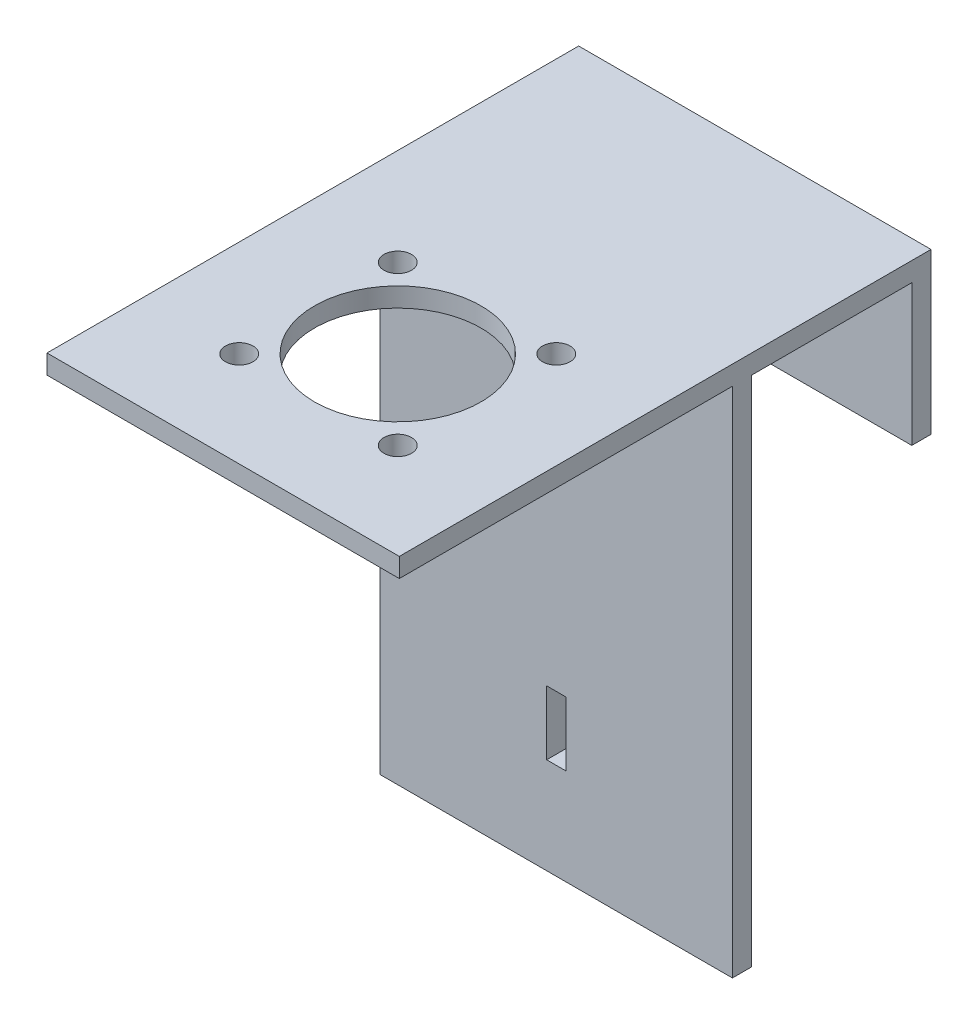
ISO-10303-21;
HEADER;
FILE_DESCRIPTION(('STEP AP214'),'2;1');
FILE_NAME('part.step','',(''),(''),'','','');
FILE_SCHEMA(('AUTOMOTIVE_DESIGN { 1 0 10303 214 1 1 1 1 }'));
ENDSEC;
DATA;
#1=APPLICATION_CONTEXT('core data for automotive mechanical design processes');
#2=APPLICATION_PROTOCOL_DEFINITION('international standard','automotive_design',2000,#1);
#3=PRODUCT_CONTEXT('',#1,'mechanical');
#4=PRODUCT('Part','Part','',(#3));
#5=PRODUCT_RELATED_PRODUCT_CATEGORY('part','',(#4));
#6=PRODUCT_DEFINITION_FORMATION('','',#4);
#7=PRODUCT_DEFINITION_CONTEXT('part definition',#1,'design');
#8=PRODUCT_DEFINITION('design','',#6,#7);
#9=PRODUCT_DEFINITION_SHAPE('','',#8);
#10=(LENGTH_UNIT() NAMED_UNIT(*) SI_UNIT(.MILLI.,.METRE.));
#11=(NAMED_UNIT(*) PLANE_ANGLE_UNIT() SI_UNIT($,.RADIAN.));
#12=(NAMED_UNIT(*) SI_UNIT($,.STERADIAN.) SOLID_ANGLE_UNIT());
#13=UNCERTAINTY_MEASURE_WITH_UNIT(LENGTH_MEASURE(1.E-05),#10,'distance_accuracy_value','');
#14=(GEOMETRIC_REPRESENTATION_CONTEXT(3) GLOBAL_UNCERTAINTY_ASSIGNED_CONTEXT((#13)) GLOBAL_UNIT_ASSIGNED_CONTEXT((#10,
#11,#12)) REPRESENTATION_CONTEXT('',''));
#15=CARTESIAN_POINT('',(0.,0.,0.));
#16=DIRECTION('',(0.,0.,1.));
#17=DIRECTION('',(1.,0.,0.));
#18=AXIS2_PLACEMENT_3D('',#15,#16,#17);
#19=CARTESIAN_POINT('',(0.,0.,0.));
#20=DIRECTION('',(0.,1.,0.));
#21=DIRECTION('',(0.,0.,1.));
#22=AXIS2_PLACEMENT_3D('',#19,#20,#21);
#23=PLANE('',#22);
#24=CARTESIAN_POINT('',(-12.3743686707644,0.,0.369562995436836));
#25=DIRECTION('',(0.,1.,0.));
#26=DIRECTION('',(0.,0.,1.));
#27=AXIS2_PLACEMENT_3D('',#24,#25,#26);
#28=CIRCLE('',#27,2.15);
#29=CARTESIAN_POINT('',(-12.3743686707644,0.,2.51956299543684));
#30=VERTEX_POINT('',#29);
#31=EDGE_CURVE('E249',#30,#30,#28,.T.);
#32=ORIENTED_EDGE('',*,*,#31,.T.);
#33=EDGE_LOOP('',(#32));
#34=FACE_BOUND('',#33,.T.);
#35=CARTESIAN_POINT('',(12.3743686707652,0.,25.1183003369655));
#36=DIRECTION('',(0.,1.,0.));
#37=DIRECTION('',(0.,0.,1.));
#38=AXIS2_PLACEMENT_3D('',#35,#36,#37);
#39=CIRCLE('',#38,2.15);
#40=CARTESIAN_POINT('',(12.3743686707652,0.,27.2683003369655));
#41=VERTEX_POINT('',#40);
#42=EDGE_CURVE('E237',#41,#41,#39,.T.);
#43=ORIENTED_EDGE('',*,*,#42,.T.);
#44=EDGE_LOOP('',(#43));
#45=FACE_BOUND('',#44,.T.);
#46=CARTESIAN_POINT('',(0.,0.,12.7439316662008));
#47=DIRECTION('',(0.,1.,0.));
#48=DIRECTION('',(0.,0.,1.));
#49=AXIS2_PLACEMENT_3D('',#46,#47,#48);
#50=CIRCLE('',#49,13.);
#51=CARTESIAN_POINT('',(0.,0.,25.7439316662008));
#52=VERTEX_POINT('',#51);
#53=EDGE_CURVE('E224',#52,#52,#50,.T.);
#54=ORIENTED_EDGE('',*,*,#53,.T.);
#55=EDGE_LOOP('',(#54));
#56=FACE_BOUND('',#55,.T.);
#57=CARTESIAN_POINT('',(12.3743686707646,0.,0.369562995436263));
#58=DIRECTION('',(0.,1.,0.));
#59=DIRECTION('',(0.,0.,1.));
#60=AXIS2_PLACEMENT_3D('',#57,#58,#59);
#61=CIRCLE('',#60,2.15);
#62=CARTESIAN_POINT('',(12.3743686707646,0.,2.51956299543626));
#63=VERTEX_POINT('',#62);
#64=EDGE_CURVE('E231',#63,#63,#61,.T.);
#65=ORIENTED_EDGE('',*,*,#64,.T.);
#66=EDGE_LOOP('',(#65));
#67=FACE_BOUND('',#66,.T.);
#68=CARTESIAN_POINT('',(-12.374368670764,0.,25.118300336966));
#69=DIRECTION('',(0.,1.,0.));
#70=DIRECTION('',(0.,0.,1.));
#71=AXIS2_PLACEMENT_3D('',#68,#69,#70);
#72=CIRCLE('',#71,2.15);
#73=CARTESIAN_POINT('',(-12.374368670764,0.,27.268300336966));
#74=VERTEX_POINT('',#73);
#75=EDGE_CURVE('E243',#74,#74,#72,.T.);
#76=ORIENTED_EDGE('',*,*,#75,.T.);
#77=EDGE_LOOP('',(#76));
#78=FACE_BOUND('',#77,.T.);
#79=DIRECTION('',(-1.,0.,0.));
#80=VECTOR('',#79,1.);
#81=CARTESIAN_POINT('',(-27.5,0.,-12.));
#82=LINE('',#81,#80);
#83=CARTESIAN_POINT('',(27.5,0.,-12.));
#84=VERTEX_POINT('',#83);
#85=CARTESIAN_POINT('',(-27.5,0.,-12.));
#86=VERTEX_POINT('',#85);
#87=EDGE_CURVE('E260',#84,#86,#82,.T.);
#88=ORIENTED_EDGE('',*,*,#87,.F.);
#89=DIRECTION('',(0.,0.,-1.));
#90=VECTOR('',#89,1.);
#91=CARTESIAN_POINT('',(27.5,0.,-40.));
#92=LINE('',#91,#90);
#93=CARTESIAN_POINT('',(27.5,0.,40.));
#94=VERTEX_POINT('',#93);
#95=EDGE_CURVE('E190',#94,#84,#92,.T.);
#96=ORIENTED_EDGE('',*,*,#95,.F.);
#97=DIRECTION('',(1.,0.,0.));
#98=VECTOR('',#97,1.);
#99=CARTESIAN_POINT('',(-27.5,0.,40.));
#100=LINE('',#99,#98);
#101=CARTESIAN_POINT('',(-27.5,0.,40.));
#102=VERTEX_POINT('',#101);
#103=EDGE_CURVE('E200',#102,#94,#100,.T.);
#104=ORIENTED_EDGE('',*,*,#103,.F.);
#105=DIRECTION('',(0.,0.,1.));
#106=VECTOR('',#105,1.);
#107=CARTESIAN_POINT('',(-27.5,0.,-40.));
#108=LINE('',#107,#106);
#109=EDGE_CURVE('E204',#86,#102,#108,.T.);
#110=ORIENTED_EDGE('',*,*,#109,.F.);
#111=EDGE_LOOP('',(#88,#96,#104,#110));
#112=FACE_BOUND('',#111,.T.);
#113=ADVANCED_FACE('F32',(#34,#45,#56,#67,#78,#112),#23,.F.);
#114=DIRECTION('',(1.,0.,0.));
#115=VECTOR('',#114,1.);
#116=CARTESIAN_POINT('',(-27.5,0.,-15.));
#117=LINE('',#116,#115);
#118=CARTESIAN_POINT('',(-27.5,0.,-15.));
#119=VERTEX_POINT('',#118);
#120=CARTESIAN_POINT('',(27.5,0.,-15.));
#121=VERTEX_POINT('',#120);
#122=EDGE_CURVE('E265',#119,#121,#117,.T.);
#123=ORIENTED_EDGE('',*,*,#122,.F.);
#124=CARTESIAN_POINT('',(-27.5,0.,-40.));
#125=VERTEX_POINT('',#124);
#126=EDGE_CURVE('E182',#125,#119,#108,.T.);
#127=ORIENTED_EDGE('',*,*,#126,.F.);
#128=DIRECTION('',(-1.,0.,0.));
#129=VECTOR('',#128,1.);
#130=CARTESIAN_POINT('',(-27.5,0.,-40.));
#131=LINE('',#130,#129);
#132=CARTESIAN_POINT('',(27.5,0.,-40.));
#133=VERTEX_POINT('',#132);
#134=EDGE_CURVE('E36',#133,#125,#131,.T.);
#135=ORIENTED_EDGE('',*,*,#134,.F.);
#136=EDGE_CURVE('E194',#121,#133,#92,.T.);
#137=ORIENTED_EDGE('',*,*,#136,.F.);
#138=EDGE_LOOP('',(#123,#127,#135,#137));
#139=FACE_BOUND('',#138,.T.);
#140=ADVANCED_FACE('F328',(#139),#23,.F.);
#141=CARTESIAN_POINT('',(0.,3.,0.));
#142=DIRECTION('',(0.,1.,0.));
#143=DIRECTION('',(0.,0.,1.));
#144=AXIS2_PLACEMENT_3D('',#141,#142,#143);
#145=PLANE('',#144);
#146=CARTESIAN_POINT('',(-12.374368670764,3.,25.118300336966));
#147=DIRECTION('',(0.,1.,0.));
#148=DIRECTION('',(0.,0.,1.));
#149=AXIS2_PLACEMENT_3D('',#146,#147,#148);
#150=CIRCLE('',#149,2.15);
#151=CARTESIAN_POINT('',(-12.374368670764,3.,27.268300336966));
#152=VERTEX_POINT('',#151);
#153=EDGE_CURVE('E240',#152,#152,#150,.T.);
#154=ORIENTED_EDGE('',*,*,#153,.F.);
#155=EDGE_LOOP('',(#154));
#156=FACE_BOUND('',#155,.T.);
#157=CARTESIAN_POINT('',(12.3743686707646,3.,0.369562995436263));
#158=DIRECTION('',(0.,1.,0.));
#159=DIRECTION('',(0.,0.,1.));
#160=AXIS2_PLACEMENT_3D('',#157,#158,#159);
#161=CIRCLE('',#160,2.15);
#162=CARTESIAN_POINT('',(12.3743686707646,3.,2.51956299543626));
#163=VERTEX_POINT('',#162);
#164=EDGE_CURVE('E228',#163,#163,#161,.T.);
#165=ORIENTED_EDGE('',*,*,#164,.F.);
#166=EDGE_LOOP('',(#165));
#167=FACE_BOUND('',#166,.T.);
#168=DIRECTION('',(0.,0.,1.));
#169=VECTOR('',#168,1.);
#170=CARTESIAN_POINT('',(-27.5,3.,-40.));
#171=LINE('',#170,#169);
#172=CARTESIAN_POINT('',(-27.5,3.,-43.));
#173=VERTEX_POINT('',#172);
#174=CARTESIAN_POINT('',(-27.5,3.,40.));
#175=VERTEX_POINT('',#174);
#176=EDGE_CURVE('E189',#173,#175,#171,.T.);
#177=ORIENTED_EDGE('',*,*,#176,.T.);
#178=DIRECTION('',(1.,0.,0.));
#179=VECTOR('',#178,1.);
#180=CARTESIAN_POINT('',(-27.5,3.,40.));
#181=LINE('',#180,#179);
#182=CARTESIAN_POINT('',(27.5,3.,40.));
#183=VERTEX_POINT('',#182);
#184=EDGE_CURVE('E192',#175,#183,#181,.T.);
#185=ORIENTED_EDGE('',*,*,#184,.T.);
#186=DIRECTION('',(0.,0.,-1.));
#187=VECTOR('',#186,1.);
#188=CARTESIAN_POINT('',(27.5,3.,-40.));
#189=LINE('',#188,#187);
#190=CARTESIAN_POINT('',(27.5,3.,-43.));
#191=VERTEX_POINT('',#190);
#192=EDGE_CURVE('E216',#183,#191,#189,.T.);
#193=ORIENTED_EDGE('',*,*,#192,.T.);
#194=DIRECTION('',(1.,0.,0.));
#195=VECTOR('',#194,1.);
#196=CARTESIAN_POINT('',(27.5,3.,-43.));
#197=LINE('',#196,#195);
#198=EDGE_CURVE('E153',#173,#191,#197,.T.);
#199=ORIENTED_EDGE('',*,*,#198,.F.);
#200=EDGE_LOOP('',(#177,#185,#193,#199));
#201=FACE_BOUND('',#200,.T.);
#202=CARTESIAN_POINT('',(0.,3.,12.7439316662008));
#203=DIRECTION('',(0.,1.,0.));
#204=DIRECTION('',(0.,0.,1.));
#205=AXIS2_PLACEMENT_3D('',#202,#203,#204);
#206=CIRCLE('',#205,13.);
#207=CARTESIAN_POINT('',(0.,3.,25.7439316662008));
#208=VERTEX_POINT('',#207);
#209=EDGE_CURVE('E227',#208,#208,#206,.T.);
#210=ORIENTED_EDGE('',*,*,#209,.F.);
#211=EDGE_LOOP('',(#210));
#212=FACE_BOUND('',#211,.T.);
#213=CARTESIAN_POINT('',(12.3743686707652,3.,25.1183003369655));
#214=DIRECTION('',(0.,1.,0.));
#215=DIRECTION('',(0.,0.,1.));
#216=AXIS2_PLACEMENT_3D('',#213,#214,#215);
#217=CIRCLE('',#216,2.15);
#218=CARTESIAN_POINT('',(12.3743686707652,3.,27.2683003369655));
#219=VERTEX_POINT('',#218);
#220=EDGE_CURVE('E234',#219,#219,#217,.T.);
#221=ORIENTED_EDGE('',*,*,#220,.F.);
#222=EDGE_LOOP('',(#221));
#223=FACE_BOUND('',#222,.T.);
#224=CARTESIAN_POINT('',(-12.3743686707644,3.,0.369562995436836));
#225=DIRECTION('',(0.,1.,0.));
#226=DIRECTION('',(0.,0.,1.));
#227=AXIS2_PLACEMENT_3D('',#224,#225,#226);
#228=CIRCLE('',#227,2.15);
#229=CARTESIAN_POINT('',(-12.3743686707644,3.,2.51956299543684));
#230=VERTEX_POINT('',#229);
#231=EDGE_CURVE('E246',#230,#230,#228,.T.);
#232=ORIENTED_EDGE('',*,*,#231,.F.);
#233=EDGE_LOOP('',(#232));
#234=FACE_BOUND('',#233,.T.);
#235=ADVANCED_FACE('F330',(#156,#167,#201,#212,#223,#234),#145,.T.);
#236=CARTESIAN_POINT('',(-27.5,3.,-40.));
#237=DIRECTION('',(1.,0.,0.));
#238=DIRECTION('',(0.,0.,-1.));
#239=AXIS2_PLACEMENT_3D('',#236,#237,#238);
#240=PLANE('',#239);
#241=ORIENTED_EDGE('',*,*,#126,.T.);
#242=DIRECTION('',(0.,1.,0.));
#243=VECTOR('',#242,1.);
#244=CARTESIAN_POINT('',(-27.5,-80.,-15.));
#245=LINE('',#244,#243);
#246=CARTESIAN_POINT('',(-27.5,-80.,-15.));
#247=VERTEX_POINT('',#246);
#248=EDGE_CURVE('E252',#247,#119,#245,.T.);
#249=ORIENTED_EDGE('',*,*,#248,.F.);
#250=DIRECTION('',(0.,0.,-1.));
#251=VECTOR('',#250,1.);
#252=CARTESIAN_POINT('',(-27.5,-80.,-15.));
#253=LINE('',#252,#251);
#254=CARTESIAN_POINT('',(-27.5,-80.,-12.));
#255=VERTEX_POINT('',#254);
#256=EDGE_CURVE('E264',#255,#247,#253,.T.);
#257=ORIENTED_EDGE('',*,*,#256,.F.);
#258=DIRECTION('',(0.,1.,0.));
#259=VECTOR('',#258,1.);
#260=CARTESIAN_POINT('',(-27.5,-80.,-12.));
#261=LINE('',#260,#259);
#262=EDGE_CURVE('E268',#255,#86,#261,.T.);
#263=ORIENTED_EDGE('',*,*,#262,.T.);
#264=ORIENTED_EDGE('',*,*,#109,.T.);
#265=DIRECTION('',(0.,-1.,0.));
#266=VECTOR('',#265,1.);
#267=CARTESIAN_POINT('',(-27.5,3.,40.));
#268=LINE('',#267,#266);
#269=EDGE_CURVE('E215',#175,#102,#268,.T.);
#270=ORIENTED_EDGE('',*,*,#269,.F.);
#271=ORIENTED_EDGE('',*,*,#176,.F.);
#272=DIRECTION('',(0.,1.,0.));
#273=VECTOR('',#272,1.);
#274=CARTESIAN_POINT('',(-27.5,3.,-43.));
#275=LINE('',#274,#273);
#276=CARTESIAN_POINT('',(-27.5,-22.,-43.));
#277=VERTEX_POINT('',#276);
#278=EDGE_CURVE('E146',#277,#173,#275,.T.);
#279=ORIENTED_EDGE('',*,*,#278,.F.);
#280=DIRECTION('',(0.,0.,1.));
#281=VECTOR('',#280,1.);
#282=CARTESIAN_POINT('',(-27.5,-22.,-43.));
#283=LINE('',#282,#281);
#284=CARTESIAN_POINT('',(-27.5,-22.,-40.));
#285=VERTEX_POINT('',#284);
#286=EDGE_CURVE('E142',#277,#285,#283,.T.);
#287=ORIENTED_EDGE('',*,*,#286,.T.);
#288=DIRECTION('',(0.,1.,0.));
#289=VECTOR('',#288,1.);
#290=CARTESIAN_POINT('',(-27.5,3.,-40.));
#291=LINE('',#290,#289);
#292=EDGE_CURVE('E156',#285,#125,#291,.T.);
#293=ORIENTED_EDGE('',*,*,#292,.T.);
#294=EDGE_LOOP('',(#241,#249,#257,#263,#264,#270,#271,#279,#287,#293));
#295=FACE_BOUND('',#294,.T.);
#296=ADVANCED_FACE('F34',(#295),#240,.F.);
#297=CARTESIAN_POINT('',(-27.5,3.,40.));
#298=DIRECTION('',(0.,0.,-1.));
#299=DIRECTION('',(-1.,0.,0.));
#300=AXIS2_PLACEMENT_3D('',#297,#298,#299);
#301=PLANE('',#300);
#302=ORIENTED_EDGE('',*,*,#103,.T.);
#303=DIRECTION('',(0.,-1.,0.));
#304=VECTOR('',#303,1.);
#305=CARTESIAN_POINT('',(27.5,3.,40.));
#306=LINE('',#305,#304);
#307=EDGE_CURVE('E213',#183,#94,#306,.T.);
#308=ORIENTED_EDGE('',*,*,#307,.F.);
#309=ORIENTED_EDGE('',*,*,#184,.F.);
#310=ORIENTED_EDGE('',*,*,#269,.T.);
#311=EDGE_LOOP('',(#302,#308,#309,#310));
#312=FACE_BOUND('',#311,.T.);
#313=ADVANCED_FACE('F343',(#312),#301,.F.);
#314=CARTESIAN_POINT('',(27.5,3.,-40.));
#315=DIRECTION('',(-1.,0.,0.));
#316=DIRECTION('',(0.,0.,1.));
#317=AXIS2_PLACEMENT_3D('',#314,#315,#316);
#318=PLANE('',#317);
#319=ORIENTED_EDGE('',*,*,#95,.T.);
#320=DIRECTION('',(0.,1.,0.));
#321=VECTOR('',#320,1.);
#322=CARTESIAN_POINT('',(27.5,-80.,-12.));
#323=LINE('',#322,#321);
#324=CARTESIAN_POINT('',(27.5,-80.,-12.));
#325=VERTEX_POINT('',#324);
#326=EDGE_CURVE('E271',#325,#84,#323,.T.);
#327=ORIENTED_EDGE('',*,*,#326,.F.);
#328=DIRECTION('',(0.,0.,1.));
#329=VECTOR('',#328,1.);
#330=CARTESIAN_POINT('',(27.5,-80.,-15.));
#331=LINE('',#330,#329);
#332=CARTESIAN_POINT('',(27.5,-80.,-15.));
#333=VERTEX_POINT('',#332);
#334=EDGE_CURVE('E313',#333,#325,#331,.T.);
#335=ORIENTED_EDGE('',*,*,#334,.F.);
#336=DIRECTION('',(0.,1.,0.));
#337=VECTOR('',#336,1.);
#338=CARTESIAN_POINT('',(27.5,-80.,-15.));
#339=LINE('',#338,#337);
#340=EDGE_CURVE('E276',#333,#121,#339,.T.);
#341=ORIENTED_EDGE('',*,*,#340,.T.);
#342=ORIENTED_EDGE('',*,*,#136,.T.);
#343=DIRECTION('',(0.,-1.,0.));
#344=VECTOR('',#343,1.);
#345=CARTESIAN_POINT('',(27.5,3.,-40.));
#346=LINE('',#345,#344);
#347=CARTESIAN_POINT('',(27.5,-22.,-40.));
#348=VERTEX_POINT('',#347);
#349=EDGE_CURVE('E161',#133,#348,#346,.T.);
#350=ORIENTED_EDGE('',*,*,#349,.T.);
#351=DIRECTION('',(0.,0.,1.));
#352=VECTOR('',#351,1.);
#353=CARTESIAN_POINT('',(27.5,-22.,-43.));
#354=LINE('',#353,#352);
#355=CARTESIAN_POINT('',(27.5,-22.,-43.));
#356=VERTEX_POINT('',#355);
#357=EDGE_CURVE('E140',#356,#348,#354,.T.);
#358=ORIENTED_EDGE('',*,*,#357,.F.);
#359=DIRECTION('',(0.,-1.,0.));
#360=VECTOR('',#359,1.);
#361=CARTESIAN_POINT('',(27.5,3.,-43.));
#362=LINE('',#361,#360);
#363=EDGE_CURVE('E147',#191,#356,#362,.T.);
#364=ORIENTED_EDGE('',*,*,#363,.F.);
#365=ORIENTED_EDGE('',*,*,#192,.F.);
#366=ORIENTED_EDGE('',*,*,#307,.T.);
#367=EDGE_LOOP('',(#319,#327,#335,#341,#342,#350,#358,#364,#365,#366));
#368=FACE_BOUND('',#367,.T.);
#369=ADVANCED_FACE('F159',(#368),#318,.F.);
#370=CARTESIAN_POINT('',(0.,3.,12.7439316662008));
#371=DIRECTION('',(0.,-1.,0.));
#372=DIRECTION('',(0.,0.,-1.));
#373=AXIS2_PLACEMENT_3D('',#370,#371,#372);
#374=CYLINDRICAL_SURFACE('',#373,13.);
#375=ORIENTED_EDGE('',*,*,#209,.T.);
#376=EDGE_LOOP('',(#375));
#377=FACE_BOUND('',#376,.T.);
#378=ORIENTED_EDGE('',*,*,#53,.F.);
#379=EDGE_LOOP('',(#378));
#380=FACE_BOUND('',#379,.T.);
#381=ADVANCED_FACE('F342',(#377,#380),#374,.F.);
#382=CARTESIAN_POINT('',(12.3743686707646,3.,0.369562995436263));
#383=DIRECTION('',(0.,-1.,0.));
#384=DIRECTION('',(0.,0.,-1.));
#385=AXIS2_PLACEMENT_3D('',#382,#383,#384);
#386=CYLINDRICAL_SURFACE('',#385,2.15);
#387=ORIENTED_EDGE('',*,*,#164,.T.);
#388=EDGE_LOOP('',(#387));
#389=FACE_BOUND('',#388,.T.);
#390=ORIENTED_EDGE('',*,*,#64,.F.);
#391=EDGE_LOOP('',(#390));
#392=FACE_BOUND('',#391,.T.);
#393=ADVANCED_FACE('F383',(#389,#392),#386,.F.);
#394=CARTESIAN_POINT('',(12.3743686707652,3.,25.1183003369655));
#395=DIRECTION('',(0.,-1.,0.));
#396=DIRECTION('',(0.,0.,-1.));
#397=AXIS2_PLACEMENT_3D('',#394,#395,#396);
#398=CYLINDRICAL_SURFACE('',#397,2.15);
#399=ORIENTED_EDGE('',*,*,#220,.T.);
#400=EDGE_LOOP('',(#399));
#401=FACE_BOUND('',#400,.T.);
#402=ORIENTED_EDGE('',*,*,#42,.F.);
#403=EDGE_LOOP('',(#402));
#404=FACE_BOUND('',#403,.T.);
#405=ADVANCED_FACE('F377',(#401,#404),#398,.F.);
#406=CARTESIAN_POINT('',(-12.374368670764,3.,25.118300336966));
#407=DIRECTION('',(0.,-1.,0.));
#408=DIRECTION('',(0.,0.,-1.));
#409=AXIS2_PLACEMENT_3D('',#406,#407,#408);
#410=CYLINDRICAL_SURFACE('',#409,2.15);
#411=ORIENTED_EDGE('',*,*,#153,.T.);
#412=EDGE_LOOP('',(#411));
#413=FACE_BOUND('',#412,.T.);
#414=ORIENTED_EDGE('',*,*,#75,.F.);
#415=EDGE_LOOP('',(#414));
#416=FACE_BOUND('',#415,.T.);
#417=ADVANCED_FACE('F364',(#413,#416),#410,.F.);
#418=CARTESIAN_POINT('',(-12.3743686707644,3.,0.369562995436836));
#419=DIRECTION('',(0.,-1.,0.));
#420=DIRECTION('',(0.,0.,-1.));
#421=AXIS2_PLACEMENT_3D('',#418,#419,#420);
#422=CYLINDRICAL_SURFACE('',#421,2.15);
#423=ORIENTED_EDGE('',*,*,#231,.T.);
#424=EDGE_LOOP('',(#423));
#425=FACE_BOUND('',#424,.T.);
#426=ORIENTED_EDGE('',*,*,#31,.F.);
#427=EDGE_LOOP('',(#426));
#428=FACE_BOUND('',#427,.T.);
#429=ADVANCED_FACE('F361',(#425,#428),#422,.F.);
#430=CARTESIAN_POINT('',(-27.5,-80.,-15.));
#431=DIRECTION('',(0.,0.,1.));
#432=DIRECTION('',(1.,0.,0.));
#433=AXIS2_PLACEMENT_3D('',#430,#431,#432);
#434=PLANE('',#433);
#435=DIRECTION('',(-1.,0.,0.));
#436=VECTOR('',#435,1.);
#437=CARTESIAN_POINT('',(1.50000000000001,-65.,-15.));
#438=LINE('',#437,#436);
#439=CARTESIAN_POINT('',(1.50000000000001,-65.,-15.));
#440=VERTEX_POINT('',#439);
#441=CARTESIAN_POINT('',(-1.49999999999999,-65.,-15.));
#442=VERTEX_POINT('',#441);
#443=EDGE_CURVE('E164',#440,#442,#438,.T.);
#444=ORIENTED_EDGE('',*,*,#443,.F.);
#445=DIRECTION('',(0.,-1.,0.));
#446=VECTOR('',#445,1.);
#447=CARTESIAN_POINT('',(1.50000000000001,-55.,-15.));
#448=LINE('',#447,#446);
#449=CARTESIAN_POINT('',(1.50000000000001,-55.,-15.));
#450=VERTEX_POINT('',#449);
#451=EDGE_CURVE('E49',#450,#440,#448,.T.);
#452=ORIENTED_EDGE('',*,*,#451,.F.);
#453=DIRECTION('',(1.,0.,0.));
#454=VECTOR('',#453,1.);
#455=CARTESIAN_POINT('',(1.50000000000001,-55.,-15.));
#456=LINE('',#455,#454);
#457=CARTESIAN_POINT('',(-1.49999999999999,-55.,-15.));
#458=VERTEX_POINT('',#457);
#459=EDGE_CURVE('E308',#458,#450,#456,.T.);
#460=ORIENTED_EDGE('',*,*,#459,.F.);
#461=DIRECTION('',(0.,1.,0.));
#462=VECTOR('',#461,1.);
#463=CARTESIAN_POINT('',(-1.49999999999999,-55.,-15.));
#464=LINE('',#463,#462);
#465=EDGE_CURVE('E299',#442,#458,#464,.T.);
#466=ORIENTED_EDGE('',*,*,#465,.F.);
#467=EDGE_LOOP('',(#444,#452,#460,#466));
#468=FACE_BOUND('',#467,.T.);
#469=ORIENTED_EDGE('',*,*,#122,.T.);
#470=ORIENTED_EDGE('',*,*,#340,.F.);
#471=DIRECTION('',(1.,0.,0.));
#472=VECTOR('',#471,1.);
#473=CARTESIAN_POINT('',(-27.5,-80.,-15.));
#474=LINE('',#473,#472);
#475=EDGE_CURVE('E311',#247,#333,#474,.T.);
#476=ORIENTED_EDGE('',*,*,#475,.F.);
#477=ORIENTED_EDGE('',*,*,#248,.T.);
#478=EDGE_LOOP('',(#469,#470,#476,#477));
#479=FACE_BOUND('',#478,.T.);
#480=ADVANCED_FACE('F327',(#468,#479),#434,.F.);
#481=CARTESIAN_POINT('',(-27.5,-80.,-12.));
#482=DIRECTION('',(0.,0.,-1.));
#483=DIRECTION('',(-1.,0.,0.));
#484=AXIS2_PLACEMENT_3D('',#481,#482,#483);
#485=PLANE('',#484);
#486=DIRECTION('',(1.,0.,0.));
#487=VECTOR('',#486,1.);
#488=CARTESIAN_POINT('',(-27.5,-55.,-12.));
#489=LINE('',#488,#487);
#490=CARTESIAN_POINT('',(-1.49999999999999,-55.,-12.));
#491=VERTEX_POINT('',#490);
#492=CARTESIAN_POINT('',(1.50000000000001,-55.,-12.));
#493=VERTEX_POINT('',#492);
#494=EDGE_CURVE('E42',#491,#493,#489,.T.);
#495=ORIENTED_EDGE('',*,*,#494,.T.);
#496=DIRECTION('',(0.,-1.,0.));
#497=VECTOR('',#496,1.);
#498=CARTESIAN_POINT('',(1.50000000000001,-80.,-12.));
#499=LINE('',#498,#497);
#500=CARTESIAN_POINT('',(1.50000000000001,-65.,-12.));
#501=VERTEX_POINT('',#500);
#502=EDGE_CURVE('E11',#493,#501,#499,.T.);
#503=ORIENTED_EDGE('',*,*,#502,.T.);
#504=DIRECTION('',(-1.,0.,0.));
#505=VECTOR('',#504,1.);
#506=CARTESIAN_POINT('',(-27.5,-65.,-12.));
#507=LINE('',#506,#505);
#508=CARTESIAN_POINT('',(-1.49999999999999,-65.,-12.));
#509=VERTEX_POINT('',#508);
#510=EDGE_CURVE('E218',#501,#509,#507,.T.);
#511=ORIENTED_EDGE('',*,*,#510,.T.);
#512=DIRECTION('',(0.,1.,0.));
#513=VECTOR('',#512,1.);
#514=CARTESIAN_POINT('',(-1.5,-80.,-12.));
#515=LINE('',#514,#513);
#516=EDGE_CURVE('E281',#509,#491,#515,.T.);
#517=ORIENTED_EDGE('',*,*,#516,.T.);
#518=EDGE_LOOP('',(#495,#503,#511,#517));
#519=FACE_BOUND('',#518,.T.);
#520=ORIENTED_EDGE('',*,*,#87,.T.);
#521=ORIENTED_EDGE('',*,*,#262,.F.);
#522=DIRECTION('',(-1.,0.,0.));
#523=VECTOR('',#522,1.);
#524=CARTESIAN_POINT('',(-27.5,-80.,-12.));
#525=LINE('',#524,#523);
#526=EDGE_CURVE('E272',#325,#255,#525,.T.);
#527=ORIENTED_EDGE('',*,*,#526,.F.);
#528=ORIENTED_EDGE('',*,*,#326,.T.);
#529=EDGE_LOOP('',(#520,#521,#527,#528));
#530=FACE_BOUND('',#529,.T.);
#531=ADVANCED_FACE('F286',(#519,#530),#485,.F.);
#532=CARTESIAN_POINT('',(0.,-80.,0.));
#533=DIRECTION('',(0.,1.,0.));
#534=DIRECTION('',(0.,0.,1.));
#535=AXIS2_PLACEMENT_3D('',#532,#533,#534);
#536=PLANE('',#535);
#537=ORIENTED_EDGE('',*,*,#256,.T.);
#538=ORIENTED_EDGE('',*,*,#475,.T.);
#539=ORIENTED_EDGE('',*,*,#334,.T.);
#540=ORIENTED_EDGE('',*,*,#526,.T.);
#541=EDGE_LOOP('',(#537,#538,#539,#540));
#542=FACE_BOUND('',#541,.T.);
#543=ADVANCED_FACE('F317',(#542),#536,.F.);
#544=CARTESIAN_POINT('',(1.50000000000001,-55.,65.));
#545=DIRECTION('',(1.,0.,0.));
#546=DIRECTION('',(0.,0.,-1.));
#547=AXIS2_PLACEMENT_3D('',#544,#545,#546);
#548=PLANE('',#547);
#549=DIRECTION('',(0.,0.,-1.));
#550=VECTOR('',#549,1.);
#551=CARTESIAN_POINT('',(1.50000000000001,-55.,65.));
#552=LINE('',#551,#550);
#553=EDGE_CURVE('E295',#493,#450,#552,.T.);
#554=ORIENTED_EDGE('',*,*,#553,.T.);
#555=ORIENTED_EDGE('',*,*,#451,.T.);
#556=DIRECTION('',(0.,0.,-1.));
#557=VECTOR('',#556,1.);
#558=CARTESIAN_POINT('',(1.50000000000001,-65.,65.));
#559=LINE('',#558,#557);
#560=EDGE_CURVE('E303',#501,#440,#559,.T.);
#561=ORIENTED_EDGE('',*,*,#560,.F.);
#562=ORIENTED_EDGE('',*,*,#502,.F.);
#563=EDGE_LOOP('',(#554,#555,#561,#562));
#564=FACE_BOUND('',#563,.T.);
#565=ADVANCED_FACE('F433',(#564),#548,.F.);
#566=CARTESIAN_POINT('',(1.50000000000001,-55.,65.));
#567=DIRECTION('',(0.,1.,0.));
#568=DIRECTION('',(0.,0.,1.));
#569=AXIS2_PLACEMENT_3D('',#566,#567,#568);
#570=PLANE('',#569);
#571=DIRECTION('',(0.,0.,-1.));
#572=VECTOR('',#571,1.);
#573=CARTESIAN_POINT('',(-1.49999999999999,-55.,65.));
#574=LINE('',#573,#572);
#575=EDGE_CURVE('E293',#491,#458,#574,.T.);
#576=ORIENTED_EDGE('',*,*,#575,.T.);
#577=ORIENTED_EDGE('',*,*,#459,.T.);
#578=ORIENTED_EDGE('',*,*,#553,.F.);
#579=ORIENTED_EDGE('',*,*,#494,.F.);
#580=EDGE_LOOP('',(#576,#577,#578,#579));
#581=FACE_BOUND('',#580,.T.);
#582=ADVANCED_FACE('F291',(#581),#570,.F.);
#583=CARTESIAN_POINT('',(-1.49999999999999,-55.,65.));
#584=DIRECTION('',(-1.,0.,0.));
#585=DIRECTION('',(0.,-1.,0.));
#586=AXIS2_PLACEMENT_3D('',#583,#584,#585);
#587=PLANE('',#586);
#588=DIRECTION('',(0.,0.,-1.));
#589=VECTOR('',#588,1.);
#590=CARTESIAN_POINT('',(-1.49999999999999,-65.,65.));
#591=LINE('',#590,#589);
#592=EDGE_CURVE('E57',#509,#442,#591,.T.);
#593=ORIENTED_EDGE('',*,*,#592,.T.);
#594=ORIENTED_EDGE('',*,*,#465,.T.);
#595=ORIENTED_EDGE('',*,*,#575,.F.);
#596=ORIENTED_EDGE('',*,*,#516,.F.);
#597=EDGE_LOOP('',(#593,#594,#595,#596));
#598=FACE_BOUND('',#597,.T.);
#599=ADVANCED_FACE('F297',(#598),#587,.F.);
#600=CARTESIAN_POINT('',(1.50000000000001,-65.,65.));
#601=DIRECTION('',(0.,-1.,0.));
#602=DIRECTION('',(0.,0.,-1.));
#603=AXIS2_PLACEMENT_3D('',#600,#601,#602);
#604=PLANE('',#603);
#605=ORIENTED_EDGE('',*,*,#560,.T.);
#606=ORIENTED_EDGE('',*,*,#443,.T.);
#607=ORIENTED_EDGE('',*,*,#592,.F.);
#608=ORIENTED_EDGE('',*,*,#510,.F.);
#609=EDGE_LOOP('',(#605,#606,#607,#608));
#610=FACE_BOUND('',#609,.T.);
#611=ADVANCED_FACE('F474',(#610),#604,.F.);
#612=CARTESIAN_POINT('',(0.,0.,-40.));
#613=DIRECTION('',(0.,0.,-1.));
#614=DIRECTION('',(-1.,0.,0.));
#615=AXIS2_PLACEMENT_3D('',#612,#613,#614);
#616=PLANE('',#615);
#617=ORIENTED_EDGE('',*,*,#349,.F.);
#618=ORIENTED_EDGE('',*,*,#134,.T.);
#619=ORIENTED_EDGE('',*,*,#292,.F.);
#620=DIRECTION('',(-1.,0.,0.));
#621=VECTOR('',#620,1.);
#622=CARTESIAN_POINT('',(27.5,-22.,-40.));
#623=LINE('',#622,#621);
#624=EDGE_CURVE('E171',#348,#285,#623,.T.);
#625=ORIENTED_EDGE('',*,*,#624,.F.);
#626=EDGE_LOOP('',(#617,#618,#619,#625));
#627=FACE_BOUND('',#626,.T.);
#628=ADVANCED_FACE('F186',(#627),#616,.F.);
#629=CARTESIAN_POINT('',(27.5,-22.,-43.));
#630=DIRECTION('',(0.,1.,0.));
#631=DIRECTION('',(0.,0.,1.));
#632=AXIS2_PLACEMENT_3D('',#629,#630,#631);
#633=PLANE('',#632);
#634=ORIENTED_EDGE('',*,*,#624,.T.);
#635=ORIENTED_EDGE('',*,*,#286,.F.);
#636=DIRECTION('',(-1.,0.,0.));
#637=VECTOR('',#636,1.);
#638=CARTESIAN_POINT('',(27.5,-22.,-43.));
#639=LINE('',#638,#637);
#640=EDGE_CURVE('E136',#356,#277,#639,.T.);
#641=ORIENTED_EDGE('',*,*,#640,.F.);
#642=ORIENTED_EDGE('',*,*,#357,.T.);
#643=EDGE_LOOP('',(#634,#635,#641,#642));
#644=FACE_BOUND('',#643,.T.);
#645=ADVANCED_FACE('F138',(#644),#633,.F.);
#646=CARTESIAN_POINT('',(0.,0.,-43.));
#647=DIRECTION('',(0.,0.,-1.));
#648=DIRECTION('',(-1.,0.,0.));
#649=AXIS2_PLACEMENT_3D('',#646,#647,#648);
#650=PLANE('',#649);
#651=ORIENTED_EDGE('',*,*,#363,.T.);
#652=ORIENTED_EDGE('',*,*,#640,.T.);
#653=ORIENTED_EDGE('',*,*,#278,.T.);
#654=ORIENTED_EDGE('',*,*,#198,.T.);
#655=EDGE_LOOP('',(#651,#652,#653,#654));
#656=FACE_BOUND('',#655,.T.);
#657=ADVANCED_FACE('F151',(#656),#650,.T.);
#658=CLOSED_SHELL('',(#113,#140,#235,#296,#313,#369,#381,#393,#405,#417,#429,#480,#531,#543,
#565,#582,#599,#611,#628,#645,#657));
#659=MANIFOLD_SOLID_BREP('B2',#658);
#660=ADVANCED_BREP_SHAPE_REPRESENTATION('',(#18,#659),#14);
#661=SHAPE_DEFINITION_REPRESENTATION(#9,#660);
ENDSEC;
END-ISO-10303-21;
